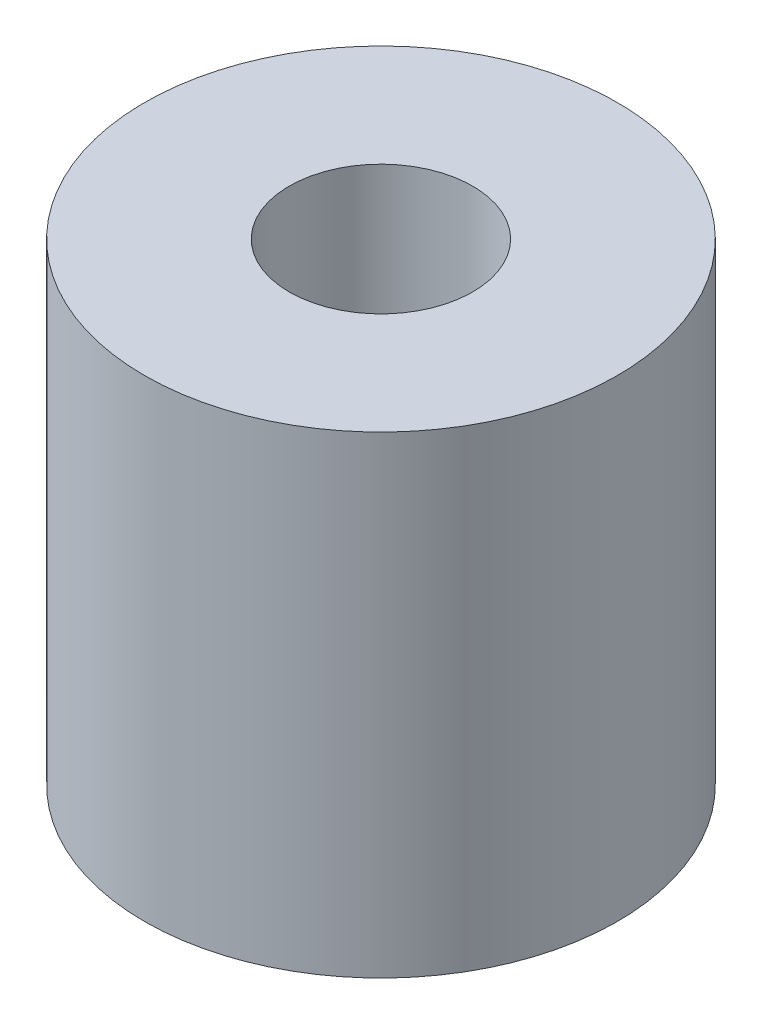
ISO-10303-21;
HEADER;
FILE_DESCRIPTION(('STEP AP214'),'2;1');
FILE_NAME('part.step','',(''),(''),'','','');
FILE_SCHEMA(('AUTOMOTIVE_DESIGN { 1 0 10303 214 1 1 1 1 }'));
ENDSEC;
DATA;
#1=APPLICATION_CONTEXT('core data for automotive mechanical design processes');
#2=APPLICATION_PROTOCOL_DEFINITION('international standard','automotive_design',2000,#1);
#3=PRODUCT_CONTEXT('',#1,'mechanical');
#4=PRODUCT('Part','Part','',(#3));
#5=PRODUCT_RELATED_PRODUCT_CATEGORY('part','',(#4));
#6=PRODUCT_DEFINITION_FORMATION('','',#4);
#7=PRODUCT_DEFINITION_CONTEXT('part definition',#1,'design');
#8=PRODUCT_DEFINITION('design','',#6,#7);
#9=PRODUCT_DEFINITION_SHAPE('','',#8);
#10=(LENGTH_UNIT() NAMED_UNIT(*) SI_UNIT(.MILLI.,.METRE.));
#11=(NAMED_UNIT(*) PLANE_ANGLE_UNIT() SI_UNIT($,.RADIAN.));
#12=(NAMED_UNIT(*) SI_UNIT($,.STERADIAN.) SOLID_ANGLE_UNIT());
#13=UNCERTAINTY_MEASURE_WITH_UNIT(LENGTH_MEASURE(1.E-05),#10,'distance_accuracy_value','');
#14=(GEOMETRIC_REPRESENTATION_CONTEXT(3) GLOBAL_UNCERTAINTY_ASSIGNED_CONTEXT((#13)) GLOBAL_UNIT_ASSIGNED_CONTEXT((#10,
#11,#12)) REPRESENTATION_CONTEXT('',''));
#15=CARTESIAN_POINT('',(0.,0.,0.));
#16=DIRECTION('',(0.,0.,1.));
#17=DIRECTION('',(1.,0.,0.));
#18=AXIS2_PLACEMENT_3D('',#15,#16,#17);
#19=CARTESIAN_POINT('',(0.,6.35,0.));
#20=DIRECTION('',(0.,-1.,0.));
#21=DIRECTION('',(0.,0.,1.));
#22=AXIS2_PLACEMENT_3D('',#19,#20,#21);
#23=CYLINDRICAL_SURFACE('',#22,2.4638);
#24=CARTESIAN_POINT('',(0.,-6.35,0.));
#25=DIRECTION('',(0.,1.,0.));
#26=DIRECTION('',(0.,0.,1.));
#27=AXIS2_PLACEMENT_3D('',#24,#25,#26);
#28=CIRCLE('',#27,2.4638);
#29=CARTESIAN_POINT('',(0.,-6.35,2.4638));
#30=VERTEX_POINT('',#29);
#31=EDGE_CURVE('E44',#30,#30,#28,.T.);
#32=ORIENTED_EDGE('',*,*,#31,.F.);
#33=EDGE_LOOP('',(#32));
#34=FACE_BOUND('',#33,.T.);
#35=CARTESIAN_POINT('',(0.,6.35,0.));
#36=DIRECTION('',(0.,1.,0.));
#37=DIRECTION('',(0.,0.,1.));
#38=AXIS2_PLACEMENT_3D('',#35,#36,#37);
#39=CIRCLE('',#38,2.4638);
#40=CARTESIAN_POINT('',(0.,6.35,2.4638));
#41=VERTEX_POINT('',#40);
#42=EDGE_CURVE('E35',#41,#41,#39,.T.);
#43=ORIENTED_EDGE('',*,*,#42,.T.);
#44=EDGE_LOOP('',(#43));
#45=FACE_BOUND('',#44,.T.);
#46=ADVANCED_FACE('F32',(#34,#45),#23,.F.);
#47=CARTESIAN_POINT('',(0.,6.35,0.));
#48=DIRECTION('',(0.,1.,0.));
#49=DIRECTION('',(0.,0.,-1.));
#50=AXIS2_PLACEMENT_3D('',#47,#48,#49);
#51=PLANE('',#50);
#52=ORIENTED_EDGE('',*,*,#42,.F.);
#53=EDGE_LOOP('',(#52));
#54=FACE_BOUND('',#53,.T.);
#55=CARTESIAN_POINT('',(0.,6.35,0.));
#56=DIRECTION('',(0.,1.,0.));
#57=DIRECTION('',(0.,0.,1.));
#58=AXIS2_PLACEMENT_3D('',#55,#56,#57);
#59=CIRCLE('',#58,6.35);
#60=CARTESIAN_POINT('',(0.,6.35,6.35));
#61=VERTEX_POINT('',#60);
#62=EDGE_CURVE('E39',#61,#61,#59,.T.);
#63=ORIENTED_EDGE('',*,*,#62,.T.);
#64=EDGE_LOOP('',(#63));
#65=FACE_BOUND('',#64,.T.);
#66=ADVANCED_FACE('F53',(#54,#65),#51,.T.);
#67=CARTESIAN_POINT('',(0.,-6.35,0.));
#68=DIRECTION('',(0.,1.,0.));
#69=DIRECTION('',(0.,0.,-1.));
#70=AXIS2_PLACEMENT_3D('',#67,#68,#69);
#71=PLANE('',#70);
#72=ORIENTED_EDGE('',*,*,#31,.T.);
#73=EDGE_LOOP('',(#72));
#74=FACE_BOUND('',#73,.T.);
#75=CARTESIAN_POINT('',(0.,-6.35,0.));
#76=DIRECTION('',(0.,1.,0.));
#77=DIRECTION('',(0.,0.,1.));
#78=AXIS2_PLACEMENT_3D('',#75,#76,#77);
#79=CIRCLE('',#78,6.35);
#80=CARTESIAN_POINT('',(0.,-6.35,6.35));
#81=VERTEX_POINT('',#80);
#82=EDGE_CURVE('E10',#81,#81,#79,.F.);
#83=ORIENTED_EDGE('',*,*,#82,.T.);
#84=EDGE_LOOP('',(#83));
#85=FACE_BOUND('',#84,.T.);
#86=ADVANCED_FACE('F56',(#74,#85),#71,.F.);
#87=CARTESIAN_POINT('',(0.,6.35,0.));
#88=DIRECTION('',(0.,-1.,0.));
#89=DIRECTION('',(0.,0.,1.));
#90=AXIS2_PLACEMENT_3D('',#87,#88,#89);
#91=CYLINDRICAL_SURFACE('',#90,6.35);
#92=ORIENTED_EDGE('',*,*,#62,.F.);
#93=EDGE_LOOP('',(#92));
#94=FACE_BOUND('',#93,.T.);
#95=ORIENTED_EDGE('',*,*,#82,.F.);
#96=EDGE_LOOP('',(#95));
#97=FACE_BOUND('',#96,.T.);
#98=ADVANCED_FACE('F59',(#94,#97),#91,.T.);
#99=CLOSED_SHELL('',(#46,#66,#86,#98));
#100=MANIFOLD_SOLID_BREP('B2',#99);
#101=ADVANCED_BREP_SHAPE_REPRESENTATION('',(#18,#100),#14);
#102=SHAPE_DEFINITION_REPRESENTATION(#9,#101);
ENDSEC;
END-ISO-10303-21;
